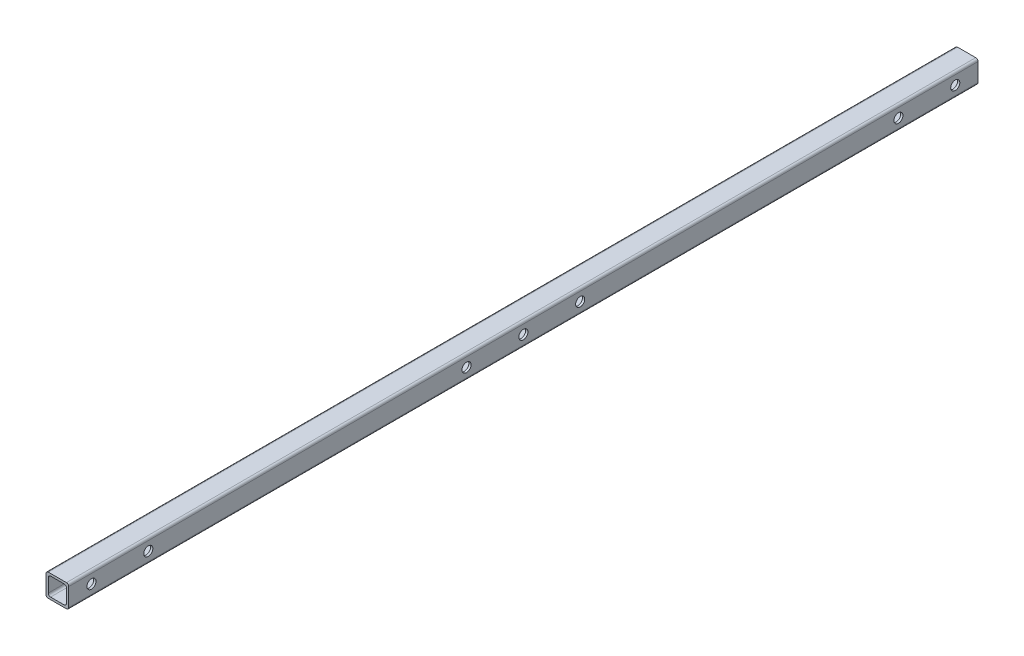
ISO-10303-21;
HEADER;
FILE_DESCRIPTION(('STEP AP214'),'2;1');
FILE_NAME('part.step','',(''),(''),'','','');
FILE_SCHEMA(('AUTOMOTIVE_DESIGN { 1 0 10303 214 1 1 1 1 }'));
ENDSEC;
DATA;
#1=APPLICATION_CONTEXT('core data for automotive mechanical design processes');
#2=APPLICATION_PROTOCOL_DEFINITION('international standard','automotive_design',2000,#1);
#3=PRODUCT_CONTEXT('',#1,'mechanical');
#4=PRODUCT('Part','Part','',(#3));
#5=PRODUCT_RELATED_PRODUCT_CATEGORY('part','',(#4));
#6=PRODUCT_DEFINITION_FORMATION('','',#4);
#7=PRODUCT_DEFINITION_CONTEXT('part definition',#1,'design');
#8=PRODUCT_DEFINITION('design','',#6,#7);
#9=PRODUCT_DEFINITION_SHAPE('','',#8);
#10=(LENGTH_UNIT() NAMED_UNIT(*) SI_UNIT(.MILLI.,.METRE.));
#11=(NAMED_UNIT(*) PLANE_ANGLE_UNIT() SI_UNIT($,.RADIAN.));
#12=(NAMED_UNIT(*) SI_UNIT($,.STERADIAN.) SOLID_ANGLE_UNIT());
#13=UNCERTAINTY_MEASURE_WITH_UNIT(LENGTH_MEASURE(1.E-05),#10,'distance_accuracy_value','');
#14=(GEOMETRIC_REPRESENTATION_CONTEXT(3) GLOBAL_UNCERTAINTY_ASSIGNED_CONTEXT((#13)) GLOBAL_UNIT_ASSIGNED_CONTEXT((#10,
#11,#12)) REPRESENTATION_CONTEXT('',''));
#15=CARTESIAN_POINT('',(0.,0.,0.));
#16=DIRECTION('',(0.,0.,1.));
#17=DIRECTION('',(1.,0.,0.));
#18=AXIS2_PLACEMENT_3D('',#15,#16,#17);
#19=CARTESIAN_POINT('',(0.,0.,-400.));
#20=DIRECTION('',(-1.,0.,0.));
#21=DIRECTION('',(0.,0.,1.));
#22=AXIS2_PLACEMENT_3D('',#19,#20,#21);
#23=PLANE('',#22);
#24=CARTESIAN_POINT('',(0.,5.,-365.));
#25=DIRECTION('',(-1.,0.,0.));
#26=DIRECTION('',(0.,0.,1.));
#27=AXIS2_PLACEMENT_3D('',#24,#25,#26);
#28=CIRCLE('',#27,1.99999999999994);
#29=CARTESIAN_POINT('',(0.,5.,-363.));
#30=VERTEX_POINT('',#29);
#31=EDGE_CURVE('E342',#30,#30,#28,.T.);
#32=ORIENTED_EDGE('',*,*,#31,.F.);
#33=EDGE_LOOP('',(#32));
#34=FACE_BOUND('',#33,.T.);
#35=CARTESIAN_POINT('',(0.,5.,-390.));
#36=DIRECTION('',(-1.,0.,0.));
#37=DIRECTION('',(0.,0.,1.));
#38=AXIS2_PLACEMENT_3D('',#35,#36,#37);
#39=CIRCLE('',#38,2.);
#40=CARTESIAN_POINT('',(0.,5.,-388.));
#41=VERTEX_POINT('',#40);
#42=EDGE_CURVE('E324',#41,#41,#39,.T.);
#43=ORIENTED_EDGE('',*,*,#42,.F.);
#44=EDGE_LOOP('',(#43));
#45=FACE_BOUND('',#44,.T.);
#46=CARTESIAN_POINT('',(0.,5.,-35.));
#47=DIRECTION('',(-1.,0.,0.));
#48=DIRECTION('',(0.,0.,1.));
#49=AXIS2_PLACEMENT_3D('',#46,#47,#48);
#50=CIRCLE('',#49,2.);
#51=CARTESIAN_POINT('',(0.,5.,-33.));
#52=VERTEX_POINT('',#51);
#53=EDGE_CURVE('E318',#52,#52,#50,.T.);
#54=ORIENTED_EDGE('',*,*,#53,.F.);
#55=EDGE_LOOP('',(#54));
#56=FACE_BOUND('',#55,.T.);
#57=CARTESIAN_POINT('',(0.,5.,-10.));
#58=DIRECTION('',(-1.,0.,0.));
#59=DIRECTION('',(0.,0.,1.));
#60=AXIS2_PLACEMENT_3D('',#57,#58,#59);
#61=CIRCLE('',#60,2.);
#62=CARTESIAN_POINT('',(0.,5.,-8.));
#63=VERTEX_POINT('',#62);
#64=EDGE_CURVE('E313',#63,#63,#61,.T.);
#65=ORIENTED_EDGE('',*,*,#64,.F.);
#66=EDGE_LOOP('',(#65));
#67=FACE_BOUND('',#66,.T.);
#68=CARTESIAN_POINT('',(0.,5.,-225.));
#69=DIRECTION('',(-1.,0.,0.));
#70=DIRECTION('',(0.,0.,1.));
#71=AXIS2_PLACEMENT_3D('',#68,#69,#70);
#72=CIRCLE('',#71,2.);
#73=CARTESIAN_POINT('',(0.,5.,-223.));
#74=VERTEX_POINT('',#73);
#75=EDGE_CURVE('E308',#74,#74,#72,.T.);
#76=ORIENTED_EDGE('',*,*,#75,.F.);
#77=EDGE_LOOP('',(#76));
#78=FACE_BOUND('',#77,.T.);
#79=CARTESIAN_POINT('',(0.,5.,-175.));
#80=DIRECTION('',(-1.,0.,0.));
#81=DIRECTION('',(0.,0.,1.));
#82=AXIS2_PLACEMENT_3D('',#79,#80,#81);
#83=CIRCLE('',#82,2.);
#84=CARTESIAN_POINT('',(0.,5.,-173.));
#85=VERTEX_POINT('',#84);
#86=EDGE_CURVE('E302',#85,#85,#83,.T.);
#87=ORIENTED_EDGE('',*,*,#86,.F.);
#88=EDGE_LOOP('',(#87));
#89=FACE_BOUND('',#88,.T.);
#90=CARTESIAN_POINT('',(0.,5.,-200.));
#91=DIRECTION('',(-1.,0.,0.));
#92=DIRECTION('',(0.,0.,1.));
#93=AXIS2_PLACEMENT_3D('',#90,#91,#92);
#94=CIRCLE('',#93,2.);
#95=CARTESIAN_POINT('',(0.,5.,-198.));
#96=VERTEX_POINT('',#95);
#97=EDGE_CURVE('E296',#96,#96,#94,.T.);
#98=ORIENTED_EDGE('',*,*,#97,.F.);
#99=EDGE_LOOP('',(#98));
#100=FACE_BOUND('',#99,.T.);
#101=DIRECTION('',(0.,-1.,0.));
#102=VECTOR('',#101,1.);
#103=CARTESIAN_POINT('',(0.,0.,-400.));
#104=LINE('',#103,#102);
#105=CARTESIAN_POINT('',(0.,9.,-400.));
#106=VERTEX_POINT('',#105);
#107=CARTESIAN_POINT('',(0.,1.,-400.));
#108=VERTEX_POINT('',#107);
#109=EDGE_CURVE('E377',#106,#108,#104,.T.);
#110=ORIENTED_EDGE('',*,*,#109,.T.);
#111=DIRECTION('',(0.,0.,1.));
#112=VECTOR('',#111,1.);
#113=CARTESIAN_POINT('',(0.,1.,-400.));
#114=LINE('',#113,#112);
#115=CARTESIAN_POINT('',(0.,1.,0.));
#116=VERTEX_POINT('',#115);
#117=EDGE_CURVE('E181',#108,#116,#114,.T.);
#118=ORIENTED_EDGE('',*,*,#117,.T.);
#119=DIRECTION('',(0.,-1.,0.));
#120=VECTOR('',#119,1.);
#121=CARTESIAN_POINT('',(0.,0.,0.));
#122=LINE('',#121,#120);
#123=CARTESIAN_POINT('',(0.,9.,0.));
#124=VERTEX_POINT('',#123);
#125=EDGE_CURVE('E164',#124,#116,#122,.T.);
#126=ORIENTED_EDGE('',*,*,#125,.F.);
#127=DIRECTION('',(0.,0.,1.));
#128=VECTOR('',#127,1.);
#129=CARTESIAN_POINT('',(0.,9.,-400.));
#130=LINE('',#129,#128);
#131=EDGE_CURVE('E178',#124,#106,#130,.F.);
#132=ORIENTED_EDGE('',*,*,#131,.T.);
#133=EDGE_LOOP('',(#110,#118,#126,#132));
#134=FACE_BOUND('',#133,.T.);
#135=ADVANCED_FACE('F44',(#34,#45,#56,#67,#78,#89,#100,#134),#23,.T.);
#136=CARTESIAN_POINT('',(0.,10.,-400.));
#137=DIRECTION('',(0.,1.,0.));
#138=DIRECTION('',(0.,0.,1.));
#139=AXIS2_PLACEMENT_3D('',#136,#137,#138);
#140=PLANE('',#139);
#141=DIRECTION('',(-1.,0.,0.));
#142=VECTOR('',#141,1.);
#143=CARTESIAN_POINT('',(0.,10.,-400.));
#144=LINE('',#143,#142);
#145=CARTESIAN_POINT('',(9.,10.,-400.));
#146=VERTEX_POINT('',#145);
#147=CARTESIAN_POINT('',(1.,10.,-400.));
#148=VERTEX_POINT('',#147);
#149=EDGE_CURVE('E190',#146,#148,#144,.T.);
#150=ORIENTED_EDGE('',*,*,#149,.T.);
#151=DIRECTION('',(0.,0.,1.));
#152=VECTOR('',#151,1.);
#153=CARTESIAN_POINT('',(1.,10.,-400.));
#154=LINE('',#153,#152);
#155=CARTESIAN_POINT('',(1.,10.,0.));
#156=VERTEX_POINT('',#155);
#157=EDGE_CURVE('E234',#148,#156,#154,.T.);
#158=ORIENTED_EDGE('',*,*,#157,.T.);
#159=DIRECTION('',(-1.,0.,0.));
#160=VECTOR('',#159,1.);
#161=CARTESIAN_POINT('',(0.,10.,0.));
#162=LINE('',#161,#160);
#163=CARTESIAN_POINT('',(9.,10.,0.));
#164=VERTEX_POINT('',#163);
#165=EDGE_CURVE('E166',#164,#156,#162,.T.);
#166=ORIENTED_EDGE('',*,*,#165,.F.);
#167=DIRECTION('',(0.,0.,1.));
#168=VECTOR('',#167,1.);
#169=CARTESIAN_POINT('',(9.,10.,-400.));
#170=LINE('',#169,#168);
#171=EDGE_CURVE('E231',#164,#146,#170,.F.);
#172=ORIENTED_EDGE('',*,*,#171,.T.);
#173=EDGE_LOOP('',(#150,#158,#166,#172));
#174=FACE_BOUND('',#173,.T.);
#175=ADVANCED_FACE('F408',(#174),#140,.T.);
#176=CARTESIAN_POINT('',(10.,0.,-400.));
#177=DIRECTION('',(1.,0.,0.));
#178=DIRECTION('',(0.,0.,-1.));
#179=AXIS2_PLACEMENT_3D('',#176,#177,#178);
#180=PLANE('',#179);
#181=CARTESIAN_POINT('',(10.,5.,-365.));
#182=DIRECTION('',(1.,0.,0.));
#183=DIRECTION('',(0.,0.,1.));
#184=AXIS2_PLACEMENT_3D('',#181,#182,#183);
#185=CIRCLE('',#184,1.99999999999994);
#186=CARTESIAN_POINT('',(10.,5.,-363.));
#187=VERTEX_POINT('',#186);
#188=EDGE_CURVE('E503',#187,#187,#185,.T.);
#189=ORIENTED_EDGE('',*,*,#188,.F.);
#190=EDGE_LOOP('',(#189));
#191=FACE_BOUND('',#190,.T.);
#192=CARTESIAN_POINT('',(10.,5.,-390.));
#193=DIRECTION('',(1.,0.,0.));
#194=DIRECTION('',(0.,0.,1.));
#195=AXIS2_PLACEMENT_3D('',#192,#193,#194);
#196=CIRCLE('',#195,2.);
#197=CARTESIAN_POINT('',(10.,5.,-388.));
#198=VERTEX_POINT('',#197);
#199=EDGE_CURVE('E507',#198,#198,#196,.T.);
#200=ORIENTED_EDGE('',*,*,#199,.F.);
#201=EDGE_LOOP('',(#200));
#202=FACE_BOUND('',#201,.T.);
#203=CARTESIAN_POINT('',(10.,5.,-35.));
#204=DIRECTION('',(1.,0.,0.));
#205=DIRECTION('',(0.,0.,-1.));
#206=AXIS2_PLACEMENT_3D('',#203,#204,#205);
#207=CIRCLE('',#206,2.);
#208=CARTESIAN_POINT('',(10.,5.,-37.));
#209=VERTEX_POINT('',#208);
#210=EDGE_CURVE('E511',#209,#209,#207,.T.);
#211=ORIENTED_EDGE('',*,*,#210,.F.);
#212=EDGE_LOOP('',(#211));
#213=FACE_BOUND('',#212,.T.);
#214=CARTESIAN_POINT('',(10.,5.,-10.));
#215=DIRECTION('',(1.,0.,0.));
#216=DIRECTION('',(0.,0.,-1.));
#217=AXIS2_PLACEMENT_3D('',#214,#215,#216);
#218=CIRCLE('',#217,2.);
#219=CARTESIAN_POINT('',(10.,5.,-12.));
#220=VERTEX_POINT('',#219);
#221=EDGE_CURVE('E515',#220,#220,#218,.T.);
#222=ORIENTED_EDGE('',*,*,#221,.F.);
#223=EDGE_LOOP('',(#222));
#224=FACE_BOUND('',#223,.T.);
#225=CARTESIAN_POINT('',(10.,5.,-225.));
#226=DIRECTION('',(1.,0.,0.));
#227=DIRECTION('',(0.,0.,-1.));
#228=AXIS2_PLACEMENT_3D('',#225,#226,#227);
#229=CIRCLE('',#228,2.);
#230=CARTESIAN_POINT('',(10.,5.,-227.));
#231=VERTEX_POINT('',#230);
#232=EDGE_CURVE('E519',#231,#231,#229,.T.);
#233=ORIENTED_EDGE('',*,*,#232,.F.);
#234=EDGE_LOOP('',(#233));
#235=FACE_BOUND('',#234,.T.);
#236=CARTESIAN_POINT('',(10.,5.,-175.));
#237=DIRECTION('',(1.,0.,0.));
#238=DIRECTION('',(0.,0.,1.));
#239=AXIS2_PLACEMENT_3D('',#236,#237,#238);
#240=CIRCLE('',#239,2.);
#241=CARTESIAN_POINT('',(10.,5.,-173.));
#242=VERTEX_POINT('',#241);
#243=EDGE_CURVE('E523',#242,#242,#240,.T.);
#244=ORIENTED_EDGE('',*,*,#243,.F.);
#245=EDGE_LOOP('',(#244));
#246=FACE_BOUND('',#245,.T.);
#247=CARTESIAN_POINT('',(10.,5.,-200.));
#248=DIRECTION('',(1.,0.,0.));
#249=DIRECTION('',(0.,0.,-1.));
#250=AXIS2_PLACEMENT_3D('',#247,#248,#249);
#251=CIRCLE('',#250,2.);
#252=CARTESIAN_POINT('',(10.,5.,-202.));
#253=VERTEX_POINT('',#252);
#254=EDGE_CURVE('E290',#253,#253,#251,.T.);
#255=ORIENTED_EDGE('',*,*,#254,.F.);
#256=EDGE_LOOP('',(#255));
#257=FACE_BOUND('',#256,.T.);
#258=DIRECTION('',(0.,1.,0.));
#259=VECTOR('',#258,1.);
#260=CARTESIAN_POINT('',(10.,0.,0.));
#261=LINE('',#260,#259);
#262=CARTESIAN_POINT('',(10.,1.,0.));
#263=VERTEX_POINT('',#262);
#264=CARTESIAN_POINT('',(10.,9.,0.));
#265=VERTEX_POINT('',#264);
#266=EDGE_CURVE('E388',#263,#265,#261,.T.);
#267=ORIENTED_EDGE('',*,*,#266,.F.);
#268=DIRECTION('',(0.,0.,1.));
#269=VECTOR('',#268,1.);
#270=CARTESIAN_POINT('',(10.,1.,-400.));
#271=LINE('',#270,#269);
#272=CARTESIAN_POINT('',(10.,1.,-400.));
#273=VERTEX_POINT('',#272);
#274=EDGE_CURVE('E69',#263,#273,#271,.F.);
#275=ORIENTED_EDGE('',*,*,#274,.T.);
#276=DIRECTION('',(0.,1.,0.));
#277=VECTOR('',#276,1.);
#278=CARTESIAN_POINT('',(10.,0.,-400.));
#279=LINE('',#278,#277);
#280=CARTESIAN_POINT('',(10.,9.,-400.));
#281=VERTEX_POINT('',#280);
#282=EDGE_CURVE('E196',#273,#281,#279,.T.);
#283=ORIENTED_EDGE('',*,*,#282,.T.);
#284=DIRECTION('',(0.,0.,1.));
#285=VECTOR('',#284,1.);
#286=CARTESIAN_POINT('',(10.,9.,-400.));
#287=LINE('',#286,#285);
#288=EDGE_CURVE('E225',#281,#265,#287,.T.);
#289=ORIENTED_EDGE('',*,*,#288,.T.);
#290=EDGE_LOOP('',(#267,#275,#283,#289));
#291=FACE_BOUND('',#290,.T.);
#292=ADVANCED_FACE('F392',(#191,#202,#213,#224,#235,#246,#257,#291),#180,.T.);
#293=CARTESIAN_POINT('',(0.,0.,-400.));
#294=DIRECTION('',(0.,-1.,0.));
#295=DIRECTION('',(0.,0.,-1.));
#296=AXIS2_PLACEMENT_3D('',#293,#294,#295);
#297=PLANE('',#296);
#298=DIRECTION('',(1.,0.,0.));
#299=VECTOR('',#298,1.);
#300=CARTESIAN_POINT('',(0.,0.,0.));
#301=LINE('',#300,#299);
#302=CARTESIAN_POINT('',(1.,0.,0.));
#303=VERTEX_POINT('',#302);
#304=CARTESIAN_POINT('',(9.,0.,0.));
#305=VERTEX_POINT('',#304);
#306=EDGE_CURVE('E183',#303,#305,#301,.T.);
#307=ORIENTED_EDGE('',*,*,#306,.F.);
#308=DIRECTION('',(0.,0.,1.));
#309=VECTOR('',#308,1.);
#310=CARTESIAN_POINT('',(1.,0.,-400.));
#311=LINE('',#310,#309);
#312=CARTESIAN_POINT('',(1.,0.,-400.));
#313=VERTEX_POINT('',#312);
#314=EDGE_CURVE('E212',#303,#313,#311,.F.);
#315=ORIENTED_EDGE('',*,*,#314,.T.);
#316=DIRECTION('',(1.,0.,0.));
#317=VECTOR('',#316,1.);
#318=CARTESIAN_POINT('',(0.,0.,-400.));
#319=LINE('',#318,#317);
#320=CARTESIAN_POINT('',(9.,0.,-400.));
#321=VERTEX_POINT('',#320);
#322=EDGE_CURVE('E380',#313,#321,#319,.T.);
#323=ORIENTED_EDGE('',*,*,#322,.T.);
#324=DIRECTION('',(0.,0.,1.));
#325=VECTOR('',#324,1.);
#326=CARTESIAN_POINT('',(9.,0.,-400.));
#327=LINE('',#326,#325);
#328=EDGE_CURVE('E208',#321,#305,#327,.T.);
#329=ORIENTED_EDGE('',*,*,#328,.T.);
#330=EDGE_LOOP('',(#307,#315,#323,#329));
#331=FACE_BOUND('',#330,.T.);
#332=ADVANCED_FACE('F403',(#331),#297,.T.);
#333=CARTESIAN_POINT('',(0.,0.,-400.));
#334=DIRECTION('',(0.,0.,-1.));
#335=DIRECTION('',(-1.,0.,0.));
#336=AXIS2_PLACEMENT_3D('',#333,#334,#335);
#337=PLANE('',#336);
#338=DIRECTION('',(-1.,0.,0.));
#339=VECTOR('',#338,1.);
#340=CARTESIAN_POINT('',(1.,9.,-400.));
#341=LINE('',#340,#339);
#342=CARTESIAN_POINT('',(8.,9.,-400.));
#343=VERTEX_POINT('',#342);
#344=CARTESIAN_POINT('',(2.,9.,-400.));
#345=VERTEX_POINT('',#344);
#346=EDGE_CURVE('E184',#343,#345,#341,.T.);
#347=ORIENTED_EDGE('',*,*,#346,.T.);
#348=CARTESIAN_POINT('',(2.,8.,-400.));
#349=DIRECTION('',(0.,0.,-1.));
#350=DIRECTION('',(-1.,0.,0.));
#351=AXIS2_PLACEMENT_3D('',#348,#349,#350);
#352=CIRCLE('',#351,1.);
#353=CARTESIAN_POINT('',(1.,8.,-400.));
#354=VERTEX_POINT('',#353);
#355=EDGE_CURVE('E268',#345,#354,#352,.F.);
#356=ORIENTED_EDGE('',*,*,#355,.T.);
#357=DIRECTION('',(0.,-1.,0.));
#358=VECTOR('',#357,1.);
#359=CARTESIAN_POINT('',(1.,1.,-400.));
#360=LINE('',#359,#358);
#361=CARTESIAN_POINT('',(1.,2.,-400.));
#362=VERTEX_POINT('',#361);
#363=EDGE_CURVE('E347',#354,#362,#360,.T.);
#364=ORIENTED_EDGE('',*,*,#363,.T.);
#365=CARTESIAN_POINT('',(2.,2.,-400.));
#366=DIRECTION('',(0.,0.,-1.));
#367=DIRECTION('',(-1.,0.,0.));
#368=AXIS2_PLACEMENT_3D('',#365,#366,#367);
#369=CIRCLE('',#368,1.);
#370=CARTESIAN_POINT('',(2.,1.,-400.));
#371=VERTEX_POINT('',#370);
#372=EDGE_CURVE('E11',#362,#371,#369,.F.);
#373=ORIENTED_EDGE('',*,*,#372,.T.);
#374=DIRECTION('',(1.,0.,0.));
#375=VECTOR('',#374,1.);
#376=CARTESIAN_POINT('',(1.,1.,-400.));
#377=LINE('',#376,#375);
#378=CARTESIAN_POINT('',(8.,1.,-400.));
#379=VERTEX_POINT('',#378);
#380=EDGE_CURVE('E351',#371,#379,#377,.T.);
#381=ORIENTED_EDGE('',*,*,#380,.T.);
#382=CARTESIAN_POINT('',(8.,2.,-400.));
#383=DIRECTION('',(0.,0.,-1.));
#384=DIRECTION('',(-1.,0.,0.));
#385=AXIS2_PLACEMENT_3D('',#382,#383,#384);
#386=CIRCLE('',#385,1.);
#387=CARTESIAN_POINT('',(9.,2.,-400.));
#388=VERTEX_POINT('',#387);
#389=EDGE_CURVE('E280',#379,#388,#386,.F.);
#390=ORIENTED_EDGE('',*,*,#389,.T.);
#391=DIRECTION('',(0.,1.,0.));
#392=VECTOR('',#391,1.);
#393=CARTESIAN_POINT('',(9.,1.,-400.));
#394=LINE('',#393,#392);
#395=CARTESIAN_POINT('',(9.,8.,-400.));
#396=VERTEX_POINT('',#395);
#397=EDGE_CURVE('E356',#388,#396,#394,.T.);
#398=ORIENTED_EDGE('',*,*,#397,.T.);
#399=CARTESIAN_POINT('',(8.,8.,-400.));
#400=DIRECTION('',(0.,0.,-1.));
#401=DIRECTION('',(-1.,0.,0.));
#402=AXIS2_PLACEMENT_3D('',#399,#400,#401);
#403=CIRCLE('',#402,1.);
#404=EDGE_CURVE('E274',#396,#343,#403,.F.);
#405=ORIENTED_EDGE('',*,*,#404,.T.);
#406=EDGE_LOOP('',(#347,#356,#364,#373,#381,#390,#398,#405));
#407=FACE_BOUND('',#406,.T.);
#408=ORIENTED_EDGE('',*,*,#322,.F.);
#409=CARTESIAN_POINT('',(1.,1.,-400.));
#410=DIRECTION('',(0.,0.,-1.));
#411=DIRECTION('',(-1.,0.,0.));
#412=AXIS2_PLACEMENT_3D('',#409,#410,#411);
#413=CIRCLE('',#412,1.);
#414=EDGE_CURVE('E222',#313,#108,#413,.T.);
#415=ORIENTED_EDGE('',*,*,#414,.T.);
#416=ORIENTED_EDGE('',*,*,#109,.F.);
#417=CARTESIAN_POINT('',(1.,9.,-400.));
#418=DIRECTION('',(0.,0.,-1.));
#419=DIRECTION('',(-1.,0.,0.));
#420=AXIS2_PLACEMENT_3D('',#417,#418,#419);
#421=CIRCLE('',#420,1.);
#422=EDGE_CURVE('E188',#106,#148,#421,.T.);
#423=ORIENTED_EDGE('',*,*,#422,.T.);
#424=ORIENTED_EDGE('',*,*,#149,.F.);
#425=CARTESIAN_POINT('',(9.,9.,-400.));
#426=DIRECTION('',(0.,0.,-1.));
#427=DIRECTION('',(-1.,0.,0.));
#428=AXIS2_PLACEMENT_3D('',#425,#426,#427);
#429=CIRCLE('',#428,1.);
#430=EDGE_CURVE('E62',#146,#281,#429,.T.);
#431=ORIENTED_EDGE('',*,*,#430,.T.);
#432=ORIENTED_EDGE('',*,*,#282,.F.);
#433=CARTESIAN_POINT('',(9.,1.,-400.));
#434=DIRECTION('',(0.,0.,-1.));
#435=DIRECTION('',(-1.,0.,0.));
#436=AXIS2_PLACEMENT_3D('',#433,#434,#435);
#437=CIRCLE('',#436,1.);
#438=EDGE_CURVE('E219',#273,#321,#437,.T.);
#439=ORIENTED_EDGE('',*,*,#438,.T.);
#440=EDGE_LOOP('',(#408,#415,#416,#423,#424,#431,#432,#439));
#441=FACE_BOUND('',#440,.T.);
#442=ADVANCED_FACE('F399',(#407,#441),#337,.T.);
#443=CARTESIAN_POINT('',(0.,0.,0.));
#444=DIRECTION('',(0.,0.,-1.));
#445=DIRECTION('',(-1.,0.,0.));
#446=AXIS2_PLACEMENT_3D('',#443,#444,#445);
#447=PLANE('',#446);
#448=DIRECTION('',(1.,0.,0.));
#449=VECTOR('',#448,1.);
#450=CARTESIAN_POINT('',(1.,1.,0.));
#451=LINE('',#450,#449);
#452=CARTESIAN_POINT('',(2.,1.,0.));
#453=VERTEX_POINT('',#452);
#454=CARTESIAN_POINT('',(8.,1.,0.));
#455=VERTEX_POINT('',#454);
#456=EDGE_CURVE('E366',#453,#455,#451,.T.);
#457=ORIENTED_EDGE('',*,*,#456,.F.);
#458=CARTESIAN_POINT('',(2.,2.,0.));
#459=DIRECTION('',(0.,0.,-1.));
#460=DIRECTION('',(-1.,0.,0.));
#461=AXIS2_PLACEMENT_3D('',#458,#459,#460);
#462=CIRCLE('',#461,1.);
#463=CARTESIAN_POINT('',(1.,2.,0.));
#464=VERTEX_POINT('',#463);
#465=EDGE_CURVE('E54',#453,#464,#462,.T.);
#466=ORIENTED_EDGE('',*,*,#465,.T.);
#467=DIRECTION('',(0.,-1.,0.));
#468=VECTOR('',#467,1.);
#469=CARTESIAN_POINT('',(1.,1.,0.));
#470=LINE('',#469,#468);
#471=CARTESIAN_POINT('',(1.,8.,0.));
#472=VERTEX_POINT('',#471);
#473=EDGE_CURVE('E346',#472,#464,#470,.T.);
#474=ORIENTED_EDGE('',*,*,#473,.F.);
#475=CARTESIAN_POINT('',(2.,8.,0.));
#476=DIRECTION('',(0.,0.,-1.));
#477=DIRECTION('',(-1.,0.,0.));
#478=AXIS2_PLACEMENT_3D('',#475,#476,#477);
#479=CIRCLE('',#478,1.);
#480=CARTESIAN_POINT('',(2.,9.,0.));
#481=VERTEX_POINT('',#480);
#482=EDGE_CURVE('E265',#472,#481,#479,.T.);
#483=ORIENTED_EDGE('',*,*,#482,.T.);
#484=DIRECTION('',(-1.,0.,0.));
#485=VECTOR('',#484,1.);
#486=CARTESIAN_POINT('',(1.,9.,0.));
#487=LINE('',#486,#485);
#488=CARTESIAN_POINT('',(8.,9.,0.));
#489=VERTEX_POINT('',#488);
#490=EDGE_CURVE('E352',#489,#481,#487,.T.);
#491=ORIENTED_EDGE('',*,*,#490,.F.);
#492=CARTESIAN_POINT('',(8.,8.,0.));
#493=DIRECTION('',(0.,0.,-1.));
#494=DIRECTION('',(-1.,0.,0.));
#495=AXIS2_PLACEMENT_3D('',#492,#493,#494);
#496=CIRCLE('',#495,1.);
#497=CARTESIAN_POINT('',(9.,8.,0.));
#498=VERTEX_POINT('',#497);
#499=EDGE_CURVE('E271',#489,#498,#496,.T.);
#500=ORIENTED_EDGE('',*,*,#499,.T.);
#501=DIRECTION('',(0.,1.,0.));
#502=VECTOR('',#501,1.);
#503=CARTESIAN_POINT('',(9.,1.,0.));
#504=LINE('',#503,#502);
#505=CARTESIAN_POINT('',(9.,2.,0.));
#506=VERTEX_POINT('',#505);
#507=EDGE_CURVE('E370',#506,#498,#504,.T.);
#508=ORIENTED_EDGE('',*,*,#507,.F.);
#509=CARTESIAN_POINT('',(8.,2.,0.));
#510=DIRECTION('',(0.,0.,-1.));
#511=DIRECTION('',(-1.,0.,0.));
#512=AXIS2_PLACEMENT_3D('',#509,#510,#511);
#513=CIRCLE('',#512,1.);
#514=EDGE_CURVE('E277',#506,#455,#513,.T.);
#515=ORIENTED_EDGE('',*,*,#514,.T.);
#516=EDGE_LOOP('',(#457,#466,#474,#483,#491,#500,#508,#515));
#517=FACE_BOUND('',#516,.T.);
#518=ORIENTED_EDGE('',*,*,#125,.T.);
#519=CARTESIAN_POINT('',(1.,1.,0.));
#520=DIRECTION('',(0.,0.,-1.));
#521=DIRECTION('',(-1.,0.,0.));
#522=AXIS2_PLACEMENT_3D('',#519,#520,#521);
#523=CIRCLE('',#522,1.);
#524=EDGE_CURVE('E205',#116,#303,#523,.F.);
#525=ORIENTED_EDGE('',*,*,#524,.T.);
#526=ORIENTED_EDGE('',*,*,#306,.T.);
#527=CARTESIAN_POINT('',(9.,1.,0.));
#528=DIRECTION('',(0.,0.,-1.));
#529=DIRECTION('',(-1.,0.,0.));
#530=AXIS2_PLACEMENT_3D('',#527,#528,#529);
#531=CIRCLE('',#530,1.);
#532=EDGE_CURVE('E172',#305,#263,#531,.F.);
#533=ORIENTED_EDGE('',*,*,#532,.T.);
#534=ORIENTED_EDGE('',*,*,#266,.T.);
#535=CARTESIAN_POINT('',(9.,9.,0.));
#536=DIRECTION('',(0.,0.,-1.));
#537=DIRECTION('',(-1.,0.,0.));
#538=AXIS2_PLACEMENT_3D('',#535,#536,#537);
#539=CIRCLE('',#538,1.);
#540=EDGE_CURVE('E173',#265,#164,#539,.F.);
#541=ORIENTED_EDGE('',*,*,#540,.T.);
#542=ORIENTED_EDGE('',*,*,#165,.T.);
#543=CARTESIAN_POINT('',(1.,9.,0.));
#544=DIRECTION('',(0.,0.,-1.));
#545=DIRECTION('',(-1.,0.,0.));
#546=AXIS2_PLACEMENT_3D('',#543,#544,#545);
#547=CIRCLE('',#546,1.);
#548=EDGE_CURVE('E161',#156,#124,#547,.F.);
#549=ORIENTED_EDGE('',*,*,#548,.T.);
#550=EDGE_LOOP('',(#518,#525,#526,#533,#534,#541,#542,#549));
#551=FACE_BOUND('',#550,.T.);
#552=ADVANCED_FACE('F163',(#517,#551),#447,.F.);
#553=CARTESIAN_POINT('',(1.,1.,-400.));
#554=DIRECTION('',(-1.,0.,0.));
#555=DIRECTION('',(0.,0.,1.));
#556=AXIS2_PLACEMENT_3D('',#553,#554,#555);
#557=PLANE('',#556);
#558=CARTESIAN_POINT('',(1.,5.,-365.));
#559=DIRECTION('',(-1.,0.,0.));
#560=DIRECTION('',(0.,0.,1.));
#561=AXIS2_PLACEMENT_3D('',#558,#559,#560);
#562=CIRCLE('',#561,1.99999999999994);
#563=CARTESIAN_POINT('',(1.,5.,-363.));
#564=VERTEX_POINT('',#563);
#565=EDGE_CURVE('E338',#564,#564,#562,.T.);
#566=ORIENTED_EDGE('',*,*,#565,.T.);
#567=EDGE_LOOP('',(#566));
#568=FACE_BOUND('',#567,.T.);
#569=CARTESIAN_POINT('',(1.,5.,-390.));
#570=DIRECTION('',(-1.,0.,0.));
#571=DIRECTION('',(0.,0.,1.));
#572=AXIS2_PLACEMENT_3D('',#569,#570,#571);
#573=CIRCLE('',#572,2.);
#574=CARTESIAN_POINT('',(1.,5.,-388.));
#575=VERTEX_POINT('',#574);
#576=EDGE_CURVE('E317',#575,#575,#573,.T.);
#577=ORIENTED_EDGE('',*,*,#576,.T.);
#578=EDGE_LOOP('',(#577));
#579=FACE_BOUND('',#578,.T.);
#580=CARTESIAN_POINT('',(1.,5.,-35.));
#581=DIRECTION('',(-1.,0.,0.));
#582=DIRECTION('',(0.,0.,1.));
#583=AXIS2_PLACEMENT_3D('',#580,#581,#582);
#584=CIRCLE('',#583,2.);
#585=CARTESIAN_POINT('',(1.,5.,-33.));
#586=VERTEX_POINT('',#585);
#587=EDGE_CURVE('E312',#586,#586,#584,.T.);
#588=ORIENTED_EDGE('',*,*,#587,.T.);
#589=EDGE_LOOP('',(#588));
#590=FACE_BOUND('',#589,.T.);
#591=CARTESIAN_POINT('',(1.,5.,-10.));
#592=DIRECTION('',(-1.,0.,0.));
#593=DIRECTION('',(0.,0.,1.));
#594=AXIS2_PLACEMENT_3D('',#591,#592,#593);
#595=CIRCLE('',#594,2.);
#596=CARTESIAN_POINT('',(1.,5.,-8.));
#597=VERTEX_POINT('',#596);
#598=EDGE_CURVE('E307',#597,#597,#595,.T.);
#599=ORIENTED_EDGE('',*,*,#598,.T.);
#600=EDGE_LOOP('',(#599));
#601=FACE_BOUND('',#600,.T.);
#602=CARTESIAN_POINT('',(1.,5.,-225.));
#603=DIRECTION('',(-1.,0.,0.));
#604=DIRECTION('',(0.,0.,1.));
#605=AXIS2_PLACEMENT_3D('',#602,#603,#604);
#606=CIRCLE('',#605,2.);
#607=CARTESIAN_POINT('',(1.,5.,-223.));
#608=VERTEX_POINT('',#607);
#609=EDGE_CURVE('E301',#608,#608,#606,.T.);
#610=ORIENTED_EDGE('',*,*,#609,.T.);
#611=EDGE_LOOP('',(#610));
#612=FACE_BOUND('',#611,.T.);
#613=CARTESIAN_POINT('',(1.,5.,-175.));
#614=DIRECTION('',(-1.,0.,0.));
#615=DIRECTION('',(0.,0.,1.));
#616=AXIS2_PLACEMENT_3D('',#613,#614,#615);
#617=CIRCLE('',#616,2.);
#618=CARTESIAN_POINT('',(1.,5.,-173.));
#619=VERTEX_POINT('',#618);
#620=EDGE_CURVE('E295',#619,#619,#617,.T.);
#621=ORIENTED_EDGE('',*,*,#620,.T.);
#622=EDGE_LOOP('',(#621));
#623=FACE_BOUND('',#622,.T.);
#624=CARTESIAN_POINT('',(1.,5.,-200.));
#625=DIRECTION('',(-1.,0.,0.));
#626=DIRECTION('',(0.,0.,1.));
#627=AXIS2_PLACEMENT_3D('',#624,#625,#626);
#628=CIRCLE('',#627,2.);
#629=CARTESIAN_POINT('',(1.,5.,-198.));
#630=VERTEX_POINT('',#629);
#631=EDGE_CURVE('E289',#630,#630,#628,.T.);
#632=ORIENTED_EDGE('',*,*,#631,.T.);
#633=EDGE_LOOP('',(#632));
#634=FACE_BOUND('',#633,.T.);
#635=ORIENTED_EDGE('',*,*,#363,.F.);
#636=DIRECTION('',(0.,0.,1.));
#637=VECTOR('',#636,1.);
#638=CARTESIAN_POINT('',(1.,8.,0.));
#639=LINE('',#638,#637);
#640=EDGE_CURVE('E240',#354,#472,#639,.T.);
#641=ORIENTED_EDGE('',*,*,#640,.T.);
#642=ORIENTED_EDGE('',*,*,#473,.T.);
#643=DIRECTION('',(0.,0.,1.));
#644=VECTOR('',#643,1.);
#645=CARTESIAN_POINT('',(1.,2.,-400.));
#646=LINE('',#645,#644);
#647=EDGE_CURVE('E237',#464,#362,#646,.F.);
#648=ORIENTED_EDGE('',*,*,#647,.T.);
#649=EDGE_LOOP('',(#635,#641,#642,#648));
#650=FACE_BOUND('',#649,.T.);
#651=ADVANCED_FACE('F479',(#568,#579,#590,#601,#612,#623,#634,#650),#557,.F.);
#652=CARTESIAN_POINT('',(1.,9.,-400.));
#653=DIRECTION('',(0.,1.,0.));
#654=DIRECTION('',(0.,0.,1.));
#655=AXIS2_PLACEMENT_3D('',#652,#653,#654);
#656=PLANE('',#655);
#657=ORIENTED_EDGE('',*,*,#490,.T.);
#658=DIRECTION('',(0.,0.,1.));
#659=VECTOR('',#658,1.);
#660=CARTESIAN_POINT('',(2.,9.,-400.));
#661=LINE('',#660,#659);
#662=EDGE_CURVE('E248',#481,#345,#661,.F.);
#663=ORIENTED_EDGE('',*,*,#662,.T.);
#664=ORIENTED_EDGE('',*,*,#346,.F.);
#665=DIRECTION('',(0.,0.,1.));
#666=VECTOR('',#665,1.);
#667=CARTESIAN_POINT('',(8.,9.,0.));
#668=LINE('',#667,#666);
#669=EDGE_CURVE('E244',#343,#489,#668,.T.);
#670=ORIENTED_EDGE('',*,*,#669,.T.);
#671=EDGE_LOOP('',(#657,#663,#664,#670));
#672=FACE_BOUND('',#671,.T.);
#673=ADVANCED_FACE('F472',(#672),#656,.F.);
#674=CARTESIAN_POINT('',(9.,1.,-400.));
#675=DIRECTION('',(1.,0.,0.));
#676=DIRECTION('',(0.,0.,-1.));
#677=AXIS2_PLACEMENT_3D('',#674,#675,#676);
#678=PLANE('',#677);
#679=CARTESIAN_POINT('',(9.,5.,-365.));
#680=DIRECTION('',(1.,0.,0.));
#681=DIRECTION('',(0.,0.,-1.));
#682=AXIS2_PLACEMENT_3D('',#679,#680,#681);
#683=CIRCLE('',#682,1.99999999999994);
#684=CARTESIAN_POINT('',(9.,5.,-367.));
#685=VERTEX_POINT('',#684);
#686=EDGE_CURVE('E48',#685,#685,#683,.T.);
#687=ORIENTED_EDGE('',*,*,#686,.T.);
#688=EDGE_LOOP('',(#687));
#689=FACE_BOUND('',#688,.T.);
#690=CARTESIAN_POINT('',(9.,5.,-390.));
#691=DIRECTION('',(1.,0.,0.));
#692=DIRECTION('',(0.,0.,-1.));
#693=AXIS2_PLACEMENT_3D('',#690,#691,#692);
#694=CIRCLE('',#693,2.);
#695=CARTESIAN_POINT('',(9.,5.,-392.));
#696=VERTEX_POINT('',#695);
#697=EDGE_CURVE('E314',#696,#696,#694,.T.);
#698=ORIENTED_EDGE('',*,*,#697,.T.);
#699=EDGE_LOOP('',(#698));
#700=FACE_BOUND('',#699,.T.);
#701=CARTESIAN_POINT('',(9.,5.,-35.));
#702=DIRECTION('',(1.,0.,0.));
#703=DIRECTION('',(0.,0.,-1.));
#704=AXIS2_PLACEMENT_3D('',#701,#702,#703);
#705=CIRCLE('',#704,2.);
#706=CARTESIAN_POINT('',(9.,5.,-37.));
#707=VERTEX_POINT('',#706);
#708=EDGE_CURVE('E309',#707,#707,#705,.T.);
#709=ORIENTED_EDGE('',*,*,#708,.T.);
#710=EDGE_LOOP('',(#709));
#711=FACE_BOUND('',#710,.T.);
#712=CARTESIAN_POINT('',(9.,5.,-10.));
#713=DIRECTION('',(1.,0.,0.));
#714=DIRECTION('',(0.,0.,-1.));
#715=AXIS2_PLACEMENT_3D('',#712,#713,#714);
#716=CIRCLE('',#715,2.);
#717=CARTESIAN_POINT('',(9.,5.,-12.));
#718=VERTEX_POINT('',#717);
#719=EDGE_CURVE('E303',#718,#718,#716,.T.);
#720=ORIENTED_EDGE('',*,*,#719,.T.);
#721=EDGE_LOOP('',(#720));
#722=FACE_BOUND('',#721,.T.);
#723=CARTESIAN_POINT('',(9.,5.,-225.));
#724=DIRECTION('',(1.,0.,0.));
#725=DIRECTION('',(0.,0.,-1.));
#726=AXIS2_PLACEMENT_3D('',#723,#724,#725);
#727=CIRCLE('',#726,2.);
#728=CARTESIAN_POINT('',(9.,5.,-227.));
#729=VERTEX_POINT('',#728);
#730=EDGE_CURVE('E297',#729,#729,#727,.T.);
#731=ORIENTED_EDGE('',*,*,#730,.T.);
#732=EDGE_LOOP('',(#731));
#733=FACE_BOUND('',#732,.T.);
#734=CARTESIAN_POINT('',(9.,5.,-175.));
#735=DIRECTION('',(1.,0.,0.));
#736=DIRECTION('',(0.,0.,-1.));
#737=AXIS2_PLACEMENT_3D('',#734,#735,#736);
#738=CIRCLE('',#737,2.);
#739=CARTESIAN_POINT('',(9.,5.,-177.));
#740=VERTEX_POINT('',#739);
#741=EDGE_CURVE('E291',#740,#740,#738,.T.);
#742=ORIENTED_EDGE('',*,*,#741,.T.);
#743=EDGE_LOOP('',(#742));
#744=FACE_BOUND('',#743,.T.);
#745=CARTESIAN_POINT('',(9.,5.,-200.));
#746=DIRECTION('',(1.,0.,0.));
#747=DIRECTION('',(0.,0.,-1.));
#748=AXIS2_PLACEMENT_3D('',#745,#746,#747);
#749=CIRCLE('',#748,2.);
#750=CARTESIAN_POINT('',(9.,5.,-202.));
#751=VERTEX_POINT('',#750);
#752=EDGE_CURVE('E285',#751,#751,#749,.T.);
#753=ORIENTED_EDGE('',*,*,#752,.T.);
#754=EDGE_LOOP('',(#753));
#755=FACE_BOUND('',#754,.T.);
#756=ORIENTED_EDGE('',*,*,#507,.T.);
#757=DIRECTION('',(0.,0.,1.));
#758=VECTOR('',#757,1.);
#759=CARTESIAN_POINT('',(9.,8.,-400.));
#760=LINE('',#759,#758);
#761=EDGE_CURVE('E255',#498,#396,#760,.F.);
#762=ORIENTED_EDGE('',*,*,#761,.T.);
#763=ORIENTED_EDGE('',*,*,#397,.F.);
#764=DIRECTION('',(0.,0.,1.));
#765=VECTOR('',#764,1.);
#766=CARTESIAN_POINT('',(9.,2.,0.));
#767=LINE('',#766,#765);
#768=EDGE_CURVE('E251',#388,#506,#767,.T.);
#769=ORIENTED_EDGE('',*,*,#768,.T.);
#770=EDGE_LOOP('',(#756,#762,#763,#769));
#771=FACE_BOUND('',#770,.T.);
#772=ADVANCED_FACE('F465',(#689,#700,#711,#722,#733,#744,#755,#771),#678,.F.);
#773=CARTESIAN_POINT('',(1.,1.,-400.));
#774=DIRECTION('',(0.,-1.,0.));
#775=DIRECTION('',(0.,0.,-1.));
#776=AXIS2_PLACEMENT_3D('',#773,#774,#775);
#777=PLANE('',#776);
#778=ORIENTED_EDGE('',*,*,#456,.T.);
#779=DIRECTION('',(0.,0.,1.));
#780=VECTOR('',#779,1.);
#781=CARTESIAN_POINT('',(8.,1.,-400.));
#782=LINE('',#781,#780);
#783=EDGE_CURVE('E262',#455,#379,#782,.F.);
#784=ORIENTED_EDGE('',*,*,#783,.T.);
#785=ORIENTED_EDGE('',*,*,#380,.F.);
#786=DIRECTION('',(0.,0.,1.));
#787=VECTOR('',#786,1.);
#788=CARTESIAN_POINT('',(2.,1.,0.));
#789=LINE('',#788,#787);
#790=EDGE_CURVE('E258',#371,#453,#789,.T.);
#791=ORIENTED_EDGE('',*,*,#790,.T.);
#792=EDGE_LOOP('',(#778,#784,#785,#791));
#793=FACE_BOUND('',#792,.T.);
#794=ADVANCED_FACE('F440',(#793),#777,.F.);
#795=CARTESIAN_POINT('',(1.,1.,-400.));
#796=DIRECTION('',(0.,0.,1.));
#797=DIRECTION('',(1.,0.,0.));
#798=AXIS2_PLACEMENT_3D('',#795,#796,#797);
#799=CYLINDRICAL_SURFACE('',#798,1.);
#800=ORIENTED_EDGE('',*,*,#414,.F.);
#801=ORIENTED_EDGE('',*,*,#314,.F.);
#802=ORIENTED_EDGE('',*,*,#524,.F.);
#803=ORIENTED_EDGE('',*,*,#117,.F.);
#804=EDGE_LOOP('',(#800,#801,#802,#803));
#805=FACE_BOUND('',#804,.T.);
#806=ADVANCED_FACE('F406',(#805),#799,.T.);
#807=CARTESIAN_POINT('',(9.,1.,-400.));
#808=DIRECTION('',(0.,0.,1.));
#809=DIRECTION('',(1.,0.,0.));
#810=AXIS2_PLACEMENT_3D('',#807,#808,#809);
#811=CYLINDRICAL_SURFACE('',#810,1.);
#812=ORIENTED_EDGE('',*,*,#438,.F.);
#813=ORIENTED_EDGE('',*,*,#274,.F.);
#814=ORIENTED_EDGE('',*,*,#532,.F.);
#815=ORIENTED_EDGE('',*,*,#328,.F.);
#816=EDGE_LOOP('',(#812,#813,#814,#815));
#817=FACE_BOUND('',#816,.T.);
#818=ADVANCED_FACE('F396',(#817),#811,.T.);
#819=CARTESIAN_POINT('',(1.,9.,-400.));
#820=DIRECTION('',(0.,0.,1.));
#821=DIRECTION('',(1.,0.,0.));
#822=AXIS2_PLACEMENT_3D('',#819,#820,#821);
#823=CYLINDRICAL_SURFACE('',#822,1.);
#824=ORIENTED_EDGE('',*,*,#422,.F.);
#825=ORIENTED_EDGE('',*,*,#131,.F.);
#826=ORIENTED_EDGE('',*,*,#548,.F.);
#827=ORIENTED_EDGE('',*,*,#157,.F.);
#828=EDGE_LOOP('',(#824,#825,#826,#827));
#829=FACE_BOUND('',#828,.T.);
#830=ADVANCED_FACE('F187',(#829),#823,.T.);
#831=CARTESIAN_POINT('',(2.,8.,-400.));
#832=DIRECTION('',(0.,0.,-1.));
#833=DIRECTION('',(-1.,0.,0.));
#834=AXIS2_PLACEMENT_3D('',#831,#832,#833);
#835=CYLINDRICAL_SURFACE('',#834,1.);
#836=ORIENTED_EDGE('',*,*,#355,.F.);
#837=ORIENTED_EDGE('',*,*,#662,.F.);
#838=ORIENTED_EDGE('',*,*,#482,.F.);
#839=ORIENTED_EDGE('',*,*,#640,.F.);
#840=EDGE_LOOP('',(#836,#837,#838,#839));
#841=FACE_BOUND('',#840,.T.);
#842=ADVANCED_FACE('F445',(#841),#835,.F.);
#843=CARTESIAN_POINT('',(8.,8.,-400.));
#844=DIRECTION('',(0.,0.,-1.));
#845=DIRECTION('',(-1.,0.,0.));
#846=AXIS2_PLACEMENT_3D('',#843,#844,#845);
#847=CYLINDRICAL_SURFACE('',#846,1.);
#848=ORIENTED_EDGE('',*,*,#404,.F.);
#849=ORIENTED_EDGE('',*,*,#761,.F.);
#850=ORIENTED_EDGE('',*,*,#499,.F.);
#851=ORIENTED_EDGE('',*,*,#669,.F.);
#852=EDGE_LOOP('',(#848,#849,#850,#851));
#853=FACE_BOUND('',#852,.T.);
#854=ADVANCED_FACE('F448',(#853),#847,.F.);
#855=CARTESIAN_POINT('',(8.,2.,-400.));
#856=DIRECTION('',(0.,0.,-1.));
#857=DIRECTION('',(-1.,0.,0.));
#858=AXIS2_PLACEMENT_3D('',#855,#856,#857);
#859=CYLINDRICAL_SURFACE('',#858,1.);
#860=ORIENTED_EDGE('',*,*,#389,.F.);
#861=ORIENTED_EDGE('',*,*,#783,.F.);
#862=ORIENTED_EDGE('',*,*,#514,.F.);
#863=ORIENTED_EDGE('',*,*,#768,.F.);
#864=EDGE_LOOP('',(#860,#861,#862,#863));
#865=FACE_BOUND('',#864,.T.);
#866=ADVANCED_FACE('F422',(#865),#859,.F.);
#867=CARTESIAN_POINT('',(2.,2.,-400.));
#868=DIRECTION('',(0.,0.,-1.));
#869=DIRECTION('',(-1.,0.,0.));
#870=AXIS2_PLACEMENT_3D('',#867,#868,#869);
#871=CYLINDRICAL_SURFACE('',#870,1.);
#872=ORIENTED_EDGE('',*,*,#372,.F.);
#873=ORIENTED_EDGE('',*,*,#647,.F.);
#874=ORIENTED_EDGE('',*,*,#465,.F.);
#875=ORIENTED_EDGE('',*,*,#790,.F.);
#876=EDGE_LOOP('',(#872,#873,#874,#875));
#877=FACE_BOUND('',#876,.T.);
#878=ADVANCED_FACE('F413',(#877),#871,.F.);
#879=CARTESIAN_POINT('',(9.,9.,-400.));
#880=DIRECTION('',(0.,0.,1.));
#881=DIRECTION('',(1.,0.,0.));
#882=AXIS2_PLACEMENT_3D('',#879,#880,#881);
#883=CYLINDRICAL_SURFACE('',#882,1.);
#884=ORIENTED_EDGE('',*,*,#430,.F.);
#885=ORIENTED_EDGE('',*,*,#171,.F.);
#886=ORIENTED_EDGE('',*,*,#540,.F.);
#887=ORIENTED_EDGE('',*,*,#288,.F.);
#888=EDGE_LOOP('',(#884,#885,#886,#887));
#889=FACE_BOUND('',#888,.T.);
#890=ADVANCED_FACE('F46',(#889),#883,.T.);
#891=CARTESIAN_POINT('',(-16.9999999999998,5.,-200.));
#892=DIRECTION('',(1.,0.,0.));
#893=DIRECTION('',(0.,0.,-1.));
#894=AXIS2_PLACEMENT_3D('',#891,#892,#893);
#895=CYLINDRICAL_SURFACE('',#894,2.);
#896=ORIENTED_EDGE('',*,*,#254,.T.);
#897=EDGE_LOOP('',(#896));
#898=FACE_BOUND('',#897,.T.);
#899=ORIENTED_EDGE('',*,*,#752,.F.);
#900=EDGE_LOOP('',(#899));
#901=FACE_BOUND('',#900,.T.);
#902=ADVANCED_FACE('F412',(#898,#901),#895,.F.);
#903=CARTESIAN_POINT('',(-16.9999999999998,5.,-175.));
#904=DIRECTION('',(1.,0.,0.));
#905=DIRECTION('',(0.,0.,-1.));
#906=AXIS2_PLACEMENT_3D('',#903,#904,#905);
#907=CYLINDRICAL_SURFACE('',#906,2.);
#908=ORIENTED_EDGE('',*,*,#243,.T.);
#909=EDGE_LOOP('',(#908));
#910=FACE_BOUND('',#909,.T.);
#911=ORIENTED_EDGE('',*,*,#741,.F.);
#912=EDGE_LOOP('',(#911));
#913=FACE_BOUND('',#912,.T.);
#914=ADVANCED_FACE('F418',(#910,#913),#907,.F.);
#915=CARTESIAN_POINT('',(-16.9999999999998,5.,-225.));
#916=DIRECTION('',(1.,0.,0.));
#917=DIRECTION('',(0.,0.,-1.));
#918=AXIS2_PLACEMENT_3D('',#915,#916,#917);
#919=CYLINDRICAL_SURFACE('',#918,2.);
#920=ORIENTED_EDGE('',*,*,#232,.T.);
#921=EDGE_LOOP('',(#920));
#922=FACE_BOUND('',#921,.T.);
#923=ORIENTED_EDGE('',*,*,#730,.F.);
#924=EDGE_LOOP('',(#923));
#925=FACE_BOUND('',#924,.T.);
#926=ADVANCED_FACE('F645',(#922,#925),#919,.F.);
#927=CARTESIAN_POINT('',(-16.9999999999998,5.,-10.));
#928=DIRECTION('',(1.,0.,0.));
#929=DIRECTION('',(0.,0.,-1.));
#930=AXIS2_PLACEMENT_3D('',#927,#928,#929);
#931=CYLINDRICAL_SURFACE('',#930,2.);
#932=ORIENTED_EDGE('',*,*,#221,.T.);
#933=EDGE_LOOP('',(#932));
#934=FACE_BOUND('',#933,.T.);
#935=ORIENTED_EDGE('',*,*,#719,.F.);
#936=EDGE_LOOP('',(#935));
#937=FACE_BOUND('',#936,.T.);
#938=ADVANCED_FACE('F654',(#934,#937),#931,.F.);
#939=CARTESIAN_POINT('',(-16.9999999999998,5.,-35.));
#940=DIRECTION('',(1.,0.,0.));
#941=DIRECTION('',(0.,0.,-1.));
#942=AXIS2_PLACEMENT_3D('',#939,#940,#941);
#943=CYLINDRICAL_SURFACE('',#942,2.);
#944=ORIENTED_EDGE('',*,*,#210,.T.);
#945=EDGE_LOOP('',(#944));
#946=FACE_BOUND('',#945,.T.);
#947=ORIENTED_EDGE('',*,*,#708,.F.);
#948=EDGE_LOOP('',(#947));
#949=FACE_BOUND('',#948,.T.);
#950=ADVANCED_FACE('F664',(#946,#949),#943,.F.);
#951=CARTESIAN_POINT('',(-16.9999999999998,5.,-390.));
#952=DIRECTION('',(1.,0.,0.));
#953=DIRECTION('',(0.,0.,-1.));
#954=AXIS2_PLACEMENT_3D('',#951,#952,#953);
#955=CYLINDRICAL_SURFACE('',#954,2.);
#956=ORIENTED_EDGE('',*,*,#199,.T.);
#957=EDGE_LOOP('',(#956));
#958=FACE_BOUND('',#957,.T.);
#959=ORIENTED_EDGE('',*,*,#697,.F.);
#960=EDGE_LOOP('',(#959));
#961=FACE_BOUND('',#960,.T.);
#962=ADVANCED_FACE('F580',(#958,#961),#955,.F.);
#963=CARTESIAN_POINT('',(-16.9999999999998,5.,-365.));
#964=DIRECTION('',(1.,0.,0.));
#965=DIRECTION('',(0.,0.,-1.));
#966=AXIS2_PLACEMENT_3D('',#963,#964,#965);
#967=CYLINDRICAL_SURFACE('',#966,1.99999999999994);
#968=ORIENTED_EDGE('',*,*,#188,.T.);
#969=EDGE_LOOP('',(#968));
#970=FACE_BOUND('',#969,.T.);
#971=ORIENTED_EDGE('',*,*,#686,.F.);
#972=EDGE_LOOP('',(#971));
#973=FACE_BOUND('',#972,.T.);
#974=ADVANCED_FACE('F570',(#970,#973),#967,.F.);
#975=ORIENTED_EDGE('',*,*,#97,.T.);
#976=EDGE_LOOP('',(#975));
#977=FACE_BOUND('',#976,.T.);
#978=ORIENTED_EDGE('',*,*,#631,.F.);
#979=EDGE_LOOP('',(#978));
#980=FACE_BOUND('',#979,.T.);
#981=ADVANCED_FACE('F421',(#977,#980),#895,.F.);
#982=ORIENTED_EDGE('',*,*,#86,.T.);
#983=EDGE_LOOP('',(#982));
#984=FACE_BOUND('',#983,.T.);
#985=ORIENTED_EDGE('',*,*,#620,.F.);
#986=EDGE_LOOP('',(#985));
#987=FACE_BOUND('',#986,.T.);
#988=ADVANCED_FACE('F569',(#984,#987),#907,.F.);
#989=ORIENTED_EDGE('',*,*,#75,.T.);
#990=EDGE_LOOP('',(#989));
#991=FACE_BOUND('',#990,.T.);
#992=ORIENTED_EDGE('',*,*,#609,.F.);
#993=EDGE_LOOP('',(#992));
#994=FACE_BOUND('',#993,.T.);
#995=ADVANCED_FACE('F577',(#991,#994),#919,.F.);
#996=ORIENTED_EDGE('',*,*,#64,.T.);
#997=EDGE_LOOP('',(#996));
#998=FACE_BOUND('',#997,.T.);
#999=ORIENTED_EDGE('',*,*,#598,.F.);
#1000=EDGE_LOOP('',(#999));
#1001=FACE_BOUND('',#1000,.T.);
#1002=ADVANCED_FACE('F557',(#998,#1001),#931,.F.);
#1003=ORIENTED_EDGE('',*,*,#53,.T.);
#1004=EDGE_LOOP('',(#1003));
#1005=FACE_BOUND('',#1004,.T.);
#1006=ORIENTED_EDGE('',*,*,#587,.F.);
#1007=EDGE_LOOP('',(#1006));
#1008=FACE_BOUND('',#1007,.T.);
#1009=ADVANCED_FACE('F676',(#1005,#1008),#943,.F.);
#1010=ORIENTED_EDGE('',*,*,#42,.T.);
#1011=EDGE_LOOP('',(#1010));
#1012=FACE_BOUND('',#1011,.T.);
#1013=ORIENTED_EDGE('',*,*,#576,.F.);
#1014=EDGE_LOOP('',(#1013));
#1015=FACE_BOUND('',#1014,.T.);
#1016=ADVANCED_FACE('F685',(#1012,#1015),#955,.F.);
#1017=ORIENTED_EDGE('',*,*,#31,.T.);
#1018=EDGE_LOOP('',(#1017));
#1019=FACE_BOUND('',#1018,.T.);
#1020=ORIENTED_EDGE('',*,*,#565,.F.);
#1021=EDGE_LOOP('',(#1020));
#1022=FACE_BOUND('',#1021,.T.);
#1023=ADVANCED_FACE('F583',(#1019,#1022),#967,.F.);
#1024=CLOSED_SHELL('',(#135,#175,#292,#332,#442,#552,#651,#673,#772,#794,#806,#818,#830,#842,
#854,#866,#878,#890,#902,#914,#926,#938,#950,#962,#974,#981,#988,#995,#1002,#1009,#1016,#1023));
#1025=MANIFOLD_SOLID_BREP('B2',#1024);
#1026=ADVANCED_BREP_SHAPE_REPRESENTATION('',(#18,#1025),#14);
#1027=SHAPE_DEFINITION_REPRESENTATION(#9,#1026);
ENDSEC;
END-ISO-10303-21;
